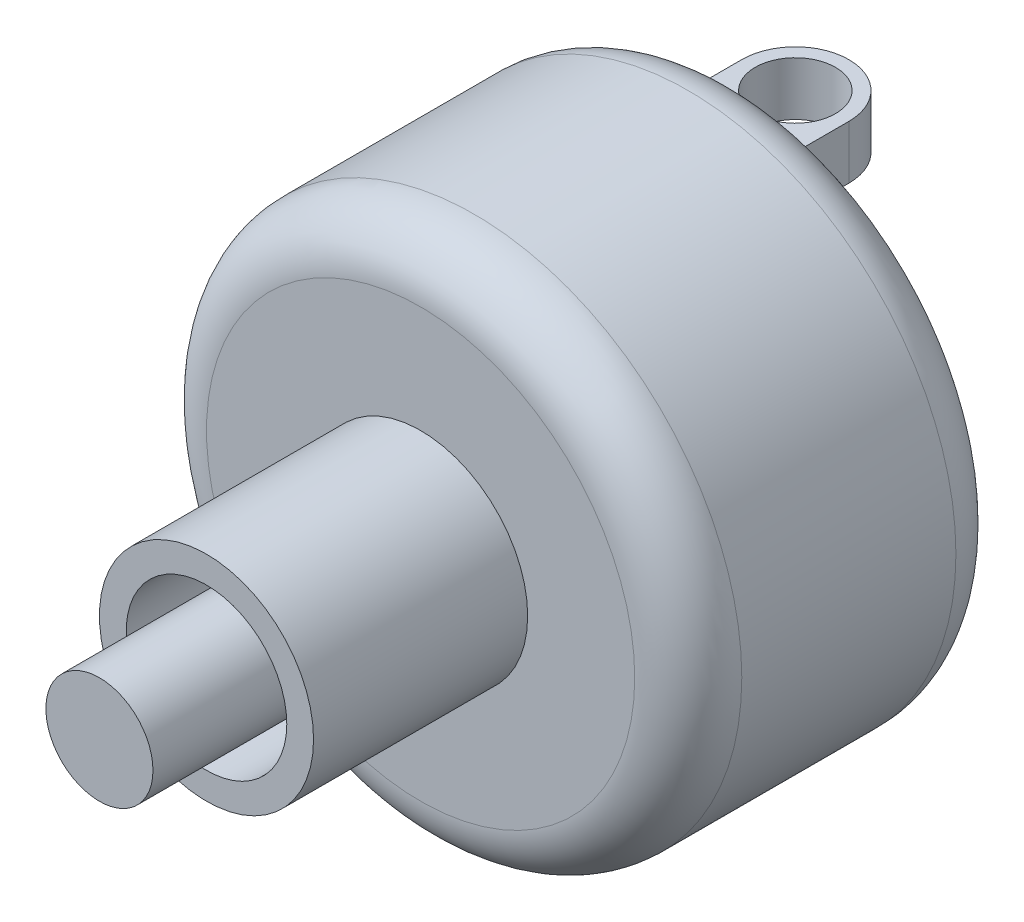
ISO-10303-21;
HEADER;
FILE_DESCRIPTION(('STEP AP214'),'2;1');
FILE_NAME('part.step','',(''),(''),'','','');
FILE_SCHEMA(('AUTOMOTIVE_DESIGN { 1 0 10303 214 1 1 1 1 }'));
ENDSEC;
DATA;
#1=APPLICATION_CONTEXT('core data for automotive mechanical design processes');
#2=APPLICATION_PROTOCOL_DEFINITION('international standard','automotive_design',2000,#1);
#3=PRODUCT_CONTEXT('',#1,'mechanical');
#4=PRODUCT('Part','Part','',(#3));
#5=PRODUCT_RELATED_PRODUCT_CATEGORY('part','',(#4));
#6=PRODUCT_DEFINITION_FORMATION('','',#4);
#7=PRODUCT_DEFINITION_CONTEXT('part definition',#1,'design');
#8=PRODUCT_DEFINITION('design','',#6,#7);
#9=PRODUCT_DEFINITION_SHAPE('','',#8);
#10=(LENGTH_UNIT() NAMED_UNIT(*) SI_UNIT(.MILLI.,.METRE.));
#11=(NAMED_UNIT(*) PLANE_ANGLE_UNIT() SI_UNIT($,.RADIAN.));
#12=(NAMED_UNIT(*) SI_UNIT($,.STERADIAN.) SOLID_ANGLE_UNIT());
#13=UNCERTAINTY_MEASURE_WITH_UNIT(LENGTH_MEASURE(1.E-05),#10,'distance_accuracy_value','');
#14=(GEOMETRIC_REPRESENTATION_CONTEXT(3) GLOBAL_UNCERTAINTY_ASSIGNED_CONTEXT((#13)) GLOBAL_UNIT_ASSIGNED_CONTEXT((#10,
#11,#12)) REPRESENTATION_CONTEXT('',''));
#15=CARTESIAN_POINT('',(0.,0.,0.));
#16=DIRECTION('',(0.,0.,1.));
#17=DIRECTION('',(1.,0.,0.));
#18=AXIS2_PLACEMENT_3D('',#15,#16,#17);
#19=CARTESIAN_POINT('',(0.,0.,0.));
#20=DIRECTION('',(0.,0.,1.));
#21=DIRECTION('',(1.,0.,0.));
#22=AXIS2_PLACEMENT_3D('',#19,#20,#21);
#23=PLANE('',#22);
#24=CARTESIAN_POINT('',(0.,0.,0.));
#25=DIRECTION('',(0.,0.,1.));
#26=DIRECTION('',(1.,0.,0.));
#27=AXIS2_PLACEMENT_3D('',#24,#25,#26);
#28=CIRCLE('',#27,8.5);
#29=CARTESIAN_POINT('',(8.5,0.,0.));
#30=VERTEX_POINT('',#29);
#31=EDGE_CURVE('E50',#30,#30,#28,.T.);
#32=ORIENTED_EDGE('',*,*,#31,.T.);
#33=EDGE_LOOP('',(#32));
#34=FACE_BOUND('',#33,.T.);
#35=DIRECTION('',(0.,1.,0.));
#36=VECTOR('',#35,1.);
#37=CARTESIAN_POINT('',(-5.,-20.,0.));
#38=LINE('',#37,#36);
#39=CARTESIAN_POINT('',(-5.,-19.3649167310371,0.));
#40=VERTEX_POINT('',#39);
#41=CARTESIAN_POINT('',(-5.,-15.,0.));
#42=VERTEX_POINT('',#41);
#43=EDGE_CURVE('E452',#40,#42,#38,.T.);
#44=ORIENTED_EDGE('',*,*,#43,.F.);
#45=CARTESIAN_POINT('',(0.,0.,0.));
#46=DIRECTION('',(0.,0.,1.));
#47=DIRECTION('',(1.,0.,0.));
#48=AXIS2_PLACEMENT_3D('',#45,#46,#47);
#49=CIRCLE('',#48,20.);
#50=CARTESIAN_POINT('',(-5.,19.3649167310371,0.));
#51=VERTEX_POINT('',#50);
#52=EDGE_CURVE('E155',#40,#51,#49,.F.);
#53=ORIENTED_EDGE('',*,*,#52,.T.);
#54=DIRECTION('',(0.,1.,0.));
#55=VECTOR('',#54,1.);
#56=CARTESIAN_POINT('',(-5.,15.,0.));
#57=LINE('',#56,#55);
#58=CARTESIAN_POINT('',(-5.,15.,0.));
#59=VERTEX_POINT('',#58);
#60=EDGE_CURVE('E139',#59,#51,#57,.T.);
#61=ORIENTED_EDGE('',*,*,#60,.F.);
#62=DIRECTION('',(-1.,0.,0.));
#63=VECTOR('',#62,1.);
#64=CARTESIAN_POINT('',(-5.,15.,0.));
#65=LINE('',#64,#63);
#66=CARTESIAN_POINT('',(5.,15.,0.));
#67=VERTEX_POINT('',#66);
#68=EDGE_CURVE('E147',#67,#59,#65,.T.);
#69=ORIENTED_EDGE('',*,*,#68,.F.);
#70=DIRECTION('',(0.,-1.,0.));
#71=VECTOR('',#70,1.);
#72=CARTESIAN_POINT('',(5.,15.,0.));
#73=LINE('',#72,#71);
#74=CARTESIAN_POINT('',(5.,19.3649167310371,0.));
#75=VERTEX_POINT('',#74);
#76=EDGE_CURVE('E157',#75,#67,#73,.T.);
#77=ORIENTED_EDGE('',*,*,#76,.F.);
#78=CARTESIAN_POINT('',(0.,0.,0.));
#79=DIRECTION('',(0.,0.,1.));
#80=DIRECTION('',(1.,0.,0.));
#81=AXIS2_PLACEMENT_3D('',#78,#79,#80);
#82=CIRCLE('',#81,20.);
#83=CARTESIAN_POINT('',(5.,-19.3649167310371,0.));
#84=VERTEX_POINT('',#83);
#85=EDGE_CURVE('E212',#75,#84,#82,.F.);
#86=ORIENTED_EDGE('',*,*,#85,.T.);
#87=DIRECTION('',(0.,-1.,0.));
#88=VECTOR('',#87,1.);
#89=CARTESIAN_POINT('',(5.,-20.,0.));
#90=LINE('',#89,#88);
#91=CARTESIAN_POINT('',(5.,-15.,0.));
#92=VERTEX_POINT('',#91);
#93=EDGE_CURVE('E487',#92,#84,#90,.T.);
#94=ORIENTED_EDGE('',*,*,#93,.F.);
#95=DIRECTION('',(1.,0.,0.));
#96=VECTOR('',#95,1.);
#97=CARTESIAN_POINT('',(-5.,-15.,0.));
#98=LINE('',#97,#96);
#99=EDGE_CURVE('E458',#42,#92,#98,.T.);
#100=ORIENTED_EDGE('',*,*,#99,.F.);
#101=EDGE_LOOP('',(#44,#53,#61,#69,#77,#86,#94,#100));
#102=FACE_BOUND('',#101,.T.);
#103=ADVANCED_FACE('F41',(#34,#102),#23,.F.);
#104=CARTESIAN_POINT('',(0.,0.,30.));
#105=DIRECTION('',(0.,0.,-1.));
#106=DIRECTION('',(-1.,0.,0.));
#107=AXIS2_PLACEMENT_3D('',#104,#105,#106);
#108=CYLINDRICAL_SURFACE('',#107,25.);
#109=CARTESIAN_POINT('',(0.,0.,25.));
#110=DIRECTION('',(0.,0.,1.));
#111=DIRECTION('',(1.,0.,0.));
#112=AXIS2_PLACEMENT_3D('',#109,#110,#111);
#113=CIRCLE('',#112,25.);
#114=CARTESIAN_POINT('',(25.,0.,25.));
#115=VERTEX_POINT('',#114);
#116=EDGE_CURVE('E208',#115,#115,#113,.F.);
#117=ORIENTED_EDGE('',*,*,#116,.T.);
#118=EDGE_LOOP('',(#117));
#119=FACE_BOUND('',#118,.T.);
#120=CARTESIAN_POINT('',(0.,0.,5.));
#121=DIRECTION('',(0.,0.,1.));
#122=DIRECTION('',(1.,0.,0.));
#123=AXIS2_PLACEMENT_3D('',#120,#121,#122);
#124=CIRCLE('',#123,25.);
#125=CARTESIAN_POINT('',(25.,0.,5.));
#126=VERTEX_POINT('',#125);
#127=EDGE_CURVE('E204',#126,#126,#124,.T.);
#128=ORIENTED_EDGE('',*,*,#127,.T.);
#129=EDGE_LOOP('',(#128));
#130=FACE_BOUND('',#129,.T.);
#131=ADVANCED_FACE('F333',(#119,#130),#108,.T.);
#132=CARTESIAN_POINT('',(0.,0.,30.));
#133=DIRECTION('',(0.,0.,1.));
#134=DIRECTION('',(1.,0.,0.));
#135=AXIS2_PLACEMENT_3D('',#132,#133,#134);
#136=PLANE('',#135);
#137=CARTESIAN_POINT('',(0.,0.,30.));
#138=DIRECTION('',(0.,0.,1.));
#139=DIRECTION('',(1.,0.,0.));
#140=AXIS2_PLACEMENT_3D('',#137,#138,#139);
#141=CIRCLE('',#140,20.);
#142=CARTESIAN_POINT('',(20.,0.,30.));
#143=VERTEX_POINT('',#142);
#144=EDGE_CURVE('E200',#143,#143,#141,.T.);
#145=ORIENTED_EDGE('',*,*,#144,.T.);
#146=EDGE_LOOP('',(#145));
#147=FACE_BOUND('',#146,.T.);
#148=CARTESIAN_POINT('',(0.,0.,30.));
#149=DIRECTION('',(0.,0.,1.));
#150=DIRECTION('',(1.,0.,0.));
#151=AXIS2_PLACEMENT_3D('',#148,#149,#150);
#152=CIRCLE('',#151,10.);
#153=CARTESIAN_POINT('',(10.,0.,30.));
#154=VERTEX_POINT('',#153);
#155=EDGE_CURVE('E196',#154,#154,#152,.T.);
#156=ORIENTED_EDGE('',*,*,#155,.F.);
#157=EDGE_LOOP('',(#156));
#158=FACE_BOUND('',#157,.T.);
#159=ADVANCED_FACE('F339',(#147,#158),#136,.T.);
#160=CARTESIAN_POINT('',(0.,0.,50.));
#161=DIRECTION('',(0.,0.,-1.));
#162=DIRECTION('',(-1.,0.,0.));
#163=AXIS2_PLACEMENT_3D('',#160,#161,#162);
#164=CYLINDRICAL_SURFACE('',#163,10.);
#165=CARTESIAN_POINT('',(0.,0.,50.));
#166=DIRECTION('',(0.,0.,1.));
#167=DIRECTION('',(1.,0.,0.));
#168=AXIS2_PLACEMENT_3D('',#165,#166,#167);
#169=CIRCLE('',#168,10.);
#170=CARTESIAN_POINT('',(10.,0.,50.));
#171=VERTEX_POINT('',#170);
#172=EDGE_CURVE('E189',#171,#171,#169,.T.);
#173=ORIENTED_EDGE('',*,*,#172,.F.);
#174=EDGE_LOOP('',(#173));
#175=FACE_BOUND('',#174,.T.);
#176=ORIENTED_EDGE('',*,*,#155,.T.);
#177=EDGE_LOOP('',(#176));
#178=FACE_BOUND('',#177,.T.);
#179=ADVANCED_FACE('F345',(#175,#178),#164,.T.);
#180=CARTESIAN_POINT('',(0.,0.,50.));
#181=DIRECTION('',(0.,0.,1.));
#182=DIRECTION('',(1.,0.,0.));
#183=AXIS2_PLACEMENT_3D('',#180,#181,#182);
#184=PLANE('',#183);
#185=CARTESIAN_POINT('',(0.,0.,50.));
#186=DIRECTION('',(0.,0.,1.));
#187=DIRECTION('',(1.,0.,0.));
#188=AXIS2_PLACEMENT_3D('',#185,#186,#187);
#189=CIRCLE('',#188,7.5);
#190=CARTESIAN_POINT('',(7.5,0.,50.));
#191=VERTEX_POINT('',#190);
#192=EDGE_CURVE('E181',#191,#191,#189,.T.);
#193=ORIENTED_EDGE('',*,*,#192,.F.);
#194=EDGE_LOOP('',(#193));
#195=FACE_BOUND('',#194,.T.);
#196=ORIENTED_EDGE('',*,*,#172,.T.);
#197=EDGE_LOOP('',(#196));
#198=FACE_BOUND('',#197,.T.);
#199=ADVANCED_FACE('F349',(#195,#198),#184,.T.);
#200=CARTESIAN_POINT('',(0.,0.,30.));
#201=DIRECTION('',(0.,0.,1.));
#202=DIRECTION('',(1.,0.,0.));
#203=AXIS2_PLACEMENT_3D('',#200,#201,#202);
#204=CYLINDRICAL_SURFACE('',#203,7.5);
#205=CARTESIAN_POINT('',(0.,0.,30.));
#206=DIRECTION('',(0.,0.,1.));
#207=DIRECTION('',(1.,0.,0.));
#208=AXIS2_PLACEMENT_3D('',#205,#206,#207);
#209=CIRCLE('',#208,7.5);
#210=CARTESIAN_POINT('',(7.5,0.,30.));
#211=VERTEX_POINT('',#210);
#212=EDGE_CURVE('E185',#211,#211,#209,.T.);
#213=ORIENTED_EDGE('',*,*,#212,.F.);
#214=EDGE_LOOP('',(#213));
#215=FACE_BOUND('',#214,.T.);
#216=ORIENTED_EDGE('',*,*,#192,.T.);
#217=EDGE_LOOP('',(#216));
#218=FACE_BOUND('',#217,.T.);
#219=ADVANCED_FACE('F353',(#215,#218),#204,.F.);
#220=CARTESIAN_POINT('',(0.,0.,30.));
#221=DIRECTION('',(0.,0.,1.));
#222=DIRECTION('',(1.,0.,0.));
#223=AXIS2_PLACEMENT_3D('',#220,#221,#222);
#224=PLANE('',#223);
#225=CARTESIAN_POINT('',(0.,0.,30.));
#226=DIRECTION('',(0.,0.,1.));
#227=DIRECTION('',(1.,0.,0.));
#228=AXIS2_PLACEMENT_3D('',#225,#226,#227);
#229=CIRCLE('',#228,5.);
#230=CARTESIAN_POINT('',(5.,0.,30.));
#231=VERTEX_POINT('',#230);
#232=EDGE_CURVE('E176',#231,#231,#229,.T.);
#233=ORIENTED_EDGE('',*,*,#232,.F.);
#234=EDGE_LOOP('',(#233));
#235=FACE_BOUND('',#234,.T.);
#236=ORIENTED_EDGE('',*,*,#212,.T.);
#237=EDGE_LOOP('',(#236));
#238=FACE_BOUND('',#237,.T.);
#239=ADVANCED_FACE('F357',(#235,#238),#224,.T.);
#240=CARTESIAN_POINT('',(0.,0.,60.));
#241=DIRECTION('',(0.,0.,-1.));
#242=DIRECTION('',(-1.,0.,0.));
#243=AXIS2_PLACEMENT_3D('',#240,#241,#242);
#244=CYLINDRICAL_SURFACE('',#243,5.);
#245=CARTESIAN_POINT('',(0.,0.,60.));
#246=DIRECTION('',(0.,0.,1.));
#247=DIRECTION('',(1.,0.,0.));
#248=AXIS2_PLACEMENT_3D('',#245,#246,#247);
#249=CIRCLE('',#248,5.);
#250=CARTESIAN_POINT('',(5.,0.,60.));
#251=VERTEX_POINT('',#250);
#252=EDGE_CURVE('E177',#251,#251,#249,.T.);
#253=ORIENTED_EDGE('',*,*,#252,.F.);
#254=EDGE_LOOP('',(#253));
#255=FACE_BOUND('',#254,.T.);
#256=ORIENTED_EDGE('',*,*,#232,.T.);
#257=EDGE_LOOP('',(#256));
#258=FACE_BOUND('',#257,.T.);
#259=ADVANCED_FACE('F361',(#255,#258),#244,.T.);
#260=CARTESIAN_POINT('',(0.,0.,60.));
#261=DIRECTION('',(0.,0.,1.));
#262=DIRECTION('',(1.,0.,0.));
#263=AXIS2_PLACEMENT_3D('',#260,#261,#262);
#264=PLANE('',#263);
#265=ORIENTED_EDGE('',*,*,#252,.T.);
#266=EDGE_LOOP('',(#265));
#267=FACE_BOUND('',#266,.T.);
#268=ADVANCED_FACE('F365',(#267),#264,.T.);
#269=CARTESIAN_POINT('',(0.,0.,-5.));
#270=DIRECTION('',(0.,0.,1.));
#271=DIRECTION('',(1.,0.,0.));
#272=AXIS2_PLACEMENT_3D('',#269,#270,#271);
#273=CYLINDRICAL_SURFACE('',#272,7.5);
#274=CARTESIAN_POINT('',(0.,0.,-1.));
#275=DIRECTION('',(0.,0.,1.));
#276=DIRECTION('',(1.,0.,0.));
#277=AXIS2_PLACEMENT_3D('',#274,#275,#276);
#278=CIRCLE('',#277,7.5);
#279=CARTESIAN_POINT('',(7.5,0.,-1.));
#280=VERTEX_POINT('',#279);
#281=EDGE_CURVE('E392',#280,#280,#278,.F.);
#282=ORIENTED_EDGE('',*,*,#281,.T.);
#283=EDGE_LOOP('',(#282));
#284=FACE_BOUND('',#283,.T.);
#285=CARTESIAN_POINT('',(0.,0.,-4.));
#286=DIRECTION('',(0.,0.,-1.));
#287=DIRECTION('',(-1.,0.,0.));
#288=AXIS2_PLACEMENT_3D('',#285,#286,#287);
#289=CIRCLE('',#288,7.5);
#290=CARTESIAN_POINT('',(-7.5,0.,-4.));
#291=VERTEX_POINT('',#290);
#292=EDGE_CURVE('E389',#291,#291,#289,.F.);
#293=ORIENTED_EDGE('',*,*,#292,.T.);
#294=EDGE_LOOP('',(#293));
#295=FACE_BOUND('',#294,.T.);
#296=ADVANCED_FACE('F369',(#284,#295),#273,.T.);
#297=CARTESIAN_POINT('',(0.,0.,-5.));
#298=DIRECTION('',(0.,0.,-1.));
#299=DIRECTION('',(-1.,0.,0.));
#300=AXIS2_PLACEMENT_3D('',#297,#298,#299);
#301=PLANE('',#300);
#302=CARTESIAN_POINT('',(0.,0.,-5.));
#303=DIRECTION('',(0.,0.,-1.));
#304=DIRECTION('',(-1.,0.,0.));
#305=AXIS2_PLACEMENT_3D('',#302,#303,#304);
#306=CIRCLE('',#305,6.5);
#307=CARTESIAN_POINT('',(-6.5,0.,-5.));
#308=VERTEX_POINT('',#307);
#309=EDGE_CURVE('E11',#308,#308,#306,.T.);
#310=ORIENTED_EDGE('',*,*,#309,.T.);
#311=EDGE_LOOP('',(#310));
#312=FACE_BOUND('',#311,.T.);
#313=ADVANCED_FACE('F330',(#312),#301,.T.);
#314=CARTESIAN_POINT('',(-5.,15.,-10.));
#315=DIRECTION('',(1.,0.,0.));
#316=DIRECTION('',(0.,1.,0.));
#317=AXIS2_PLACEMENT_3D('',#314,#315,#316);
#318=PLANE('',#317);
#319=DIRECTION('',(0.,0.,1.));
#320=VECTOR('',#319,1.);
#321=CARTESIAN_POINT('',(-5.,20.,-10.));
#322=LINE('',#321,#320);
#323=CARTESIAN_POINT('',(-5.,20.,-5.));
#324=VERTEX_POINT('',#323);
#325=CARTESIAN_POINT('',(-5.,20.,0.0380321319528795));
#326=VERTEX_POINT('',#325);
#327=EDGE_CURVE('E173',#324,#326,#322,.T.);
#328=ORIENTED_EDGE('',*,*,#327,.F.);
#329=DIRECTION('',(0.,1.,0.));
#330=VECTOR('',#329,1.);
#331=CARTESIAN_POINT('',(-5.,15.,-5.));
#332=LINE('',#331,#330);
#333=CARTESIAN_POINT('',(-5.,15.,-5.));
#334=VERTEX_POINT('',#333);
#335=EDGE_CURVE('E141',#324,#334,#332,.F.);
#336=ORIENTED_EDGE('',*,*,#335,.T.);
#337=DIRECTION('',(0.,0.,1.));
#338=VECTOR('',#337,1.);
#339=CARTESIAN_POINT('',(-5.,15.,-10.));
#340=LINE('',#339,#338);
#341=EDGE_CURVE('E135',#334,#59,#340,.T.);
#342=ORIENTED_EDGE('',*,*,#341,.T.);
#343=ORIENTED_EDGE('',*,*,#60,.T.);
#344=CARTESIAN_POINT('',(-5.,19.3649167310371,0.));
#345=CARTESIAN_POINT('',(-5.,19.4711435408004,-1.59857103890314E-06));
#346=CARTESIAN_POINT('',(-5.,19.5771805060712,0.00316694102008982));
#347=CARTESIAN_POINT('',(-5.,19.788874929712,0.0158443074308182));
#348=CARTESIAN_POINT('',(-5.,19.8945323874288,0.025353145157313));
#349=CARTESIAN_POINT('',(-5.,20.,0.0380321319528704));
#350=B_SPLINE_CURVE_WITH_KNOTS('',3,(#344,#345,#346,#347,#348,#349),.UNSPECIFIED.,.F.,.F.,(4,2,
4),(0.,0.318252885019034,0.636506317513864),.UNSPECIFIED.);
#351=EDGE_CURVE('E217',#51,#326,#350,.T.);
#352=ORIENTED_EDGE('',*,*,#351,.T.);
#353=EDGE_LOOP('',(#328,#336,#342,#343,#352));
#354=FACE_BOUND('',#353,.T.);
#355=ADVANCED_FACE('F137',(#354),#318,.F.);
#356=CARTESIAN_POINT('',(-5.,20.,-10.));
#357=DIRECTION('',(0.,-1.,0.));
#358=DIRECTION('',(1.,0.,0.));
#359=AXIS2_PLACEMENT_3D('',#356,#357,#358);
#360=PLANE('',#359);
#361=CARTESIAN_POINT('',(0.,20.,-5.));
#362=DIRECTION('',(0.,1.,0.));
#363=DIRECTION('',(-1.,0.,0.));
#364=AXIS2_PLACEMENT_3D('',#361,#362,#363);
#365=CIRCLE('',#364,3.75);
#366=CARTESIAN_POINT('',(-3.74999999999999,20.,-5.));
#367=VERTEX_POINT('',#366);
#368=EDGE_CURVE('E521',#367,#367,#365,.T.);
#369=ORIENTED_EDGE('',*,*,#368,.F.);
#370=EDGE_LOOP('',(#369));
#371=FACE_BOUND('',#370,.T.);
#372=DIRECTION('',(0.,0.,1.));
#373=VECTOR('',#372,1.);
#374=CARTESIAN_POINT('',(5.,20.,-10.));
#375=LINE('',#374,#373);
#376=CARTESIAN_POINT('',(5.,20.,-5.));
#377=VERTEX_POINT('',#376);
#378=CARTESIAN_POINT('',(5.,20.,0.0380321319528778));
#379=VERTEX_POINT('',#378);
#380=EDGE_CURVE('E170',#377,#379,#375,.T.);
#381=ORIENTED_EDGE('',*,*,#380,.F.);
#382=CARTESIAN_POINT('',(0.,20.,-5.));
#383=DIRECTION('',(0.,-1.,0.));
#384=DIRECTION('',(1.,0.,0.));
#385=AXIS2_PLACEMENT_3D('',#382,#383,#384);
#386=CIRCLE('',#385,5.);
#387=CARTESIAN_POINT('',(0.,20.,-10.));
#388=VERTEX_POINT('',#387);
#389=EDGE_CURVE('E62',#377,#388,#386,.F.);
#390=ORIENTED_EDGE('',*,*,#389,.T.);
#391=CARTESIAN_POINT('',(0.,20.,-5.));
#392=DIRECTION('',(0.,-1.,0.));
#393=DIRECTION('',(1.,0.,0.));
#394=AXIS2_PLACEMENT_3D('',#391,#392,#393);
#395=CIRCLE('',#394,5.);
#396=EDGE_CURVE('E57',#388,#324,#395,.F.);
#397=ORIENTED_EDGE('',*,*,#396,.T.);
#398=ORIENTED_EDGE('',*,*,#327,.T.);
#399=CARTESIAN_POINT('',(-5.,20.,0.0380321319528789));
#400=CARTESIAN_POINT('',(-4.79172627708819,20.,0.0317770860692456));
#401=CARTESIAN_POINT('',(-4.58342331012892,20.,0.0266509781953639));
#402=CARTESIAN_POINT('',(-4.16678753030685,20.,0.0181852564625262));
#403=CARTESIAN_POINT('',(-3.95845471870868,20.,0.0148455815006976));
#404=CARTESIAN_POINT('',(-3.54178342100838,20.,0.00948110610459965));
#405=CARTESIAN_POINT('',(-3.33344493563177,20.,0.00745624395064969));
#406=CARTESIAN_POINT('',(-2.91675939888512,20.,0.00432982564868455));
#407=CARTESIAN_POINT('',(-2.70841234745178,20.,0.00322827841668376));
#408=CARTESIAN_POINT('',(-2.29173129729011,20.,0.00161848481480243));
#409=CARTESIAN_POINT('',(-2.08339729870398,20.,0.00111019566597089));
#410=CARTESIAN_POINT('',(-1.66672960605639,20.,0.000428330578891939));
#411=CARTESIAN_POINT('',(-1.45839591199652,20.,0.000254753442649956));
#412=CARTESIAN_POINT('',(-1.04171872902487,20.,4.98880398136789E-05));
#413=CARTESIAN_POINT('',(-0.833375240111585,20.,1.86064411764695E-05));
#414=CARTESIAN_POINT('',(-0.41668783052716,20.,4.61610223762926E-07));
#415=CARTESIAN_POINT('',(-0.208343909856013,20.,1.35984688042701E-05));
#416=CARTESIAN_POINT('',(0.,20.,0.));
#417=B_SPLINE_CURVE_WITH_KNOTS('',3,(#399,#400,#401,#402,#403,#404,#405,#406,#407,#408,#409,
#410,#411,#412,#413,#414,#415,#416),.UNSPECIFIED.,.F.,.F.,(4,2,2,2,2,2,2,2,4),(0.,
0.625093183831321,1.25016498570549,1.87520744346218,2.50025593688797,3.12525935621882,
3.75026053854571,4.37529100807446,5.00032275663922),.UNSPECIFIED.);
#418=CARTESIAN_POINT('',(0.,20.,0.));
#419=VERTEX_POINT('',#418);
#420=EDGE_CURVE('E226',#326,#419,#417,.T.);
#421=ORIENTED_EDGE('',*,*,#420,.T.);
#422=CARTESIAN_POINT('',(0.,20.,0.));
#423=CARTESIAN_POINT('',(0.208343909856026,20.,1.35984688049139E-05));
#424=CARTESIAN_POINT('',(0.416687830527172,20.,4.61610224618808E-07));
#425=CARTESIAN_POINT('',(0.833375240111596,20.,1.86064411769823E-05));
#426=CARTESIAN_POINT('',(1.04171872902488,20.,4.98880398136365E-05));
#427=CARTESIAN_POINT('',(1.45839591199653,20.,0.000254753442649378));
#428=CARTESIAN_POINT('',(1.6667296060564,20.,0.000428330578891381));
#429=CARTESIAN_POINT('',(2.08339729870398,20.,0.00111019566597043));
#430=CARTESIAN_POINT('',(2.29173129729012,20.,0.00161848481480206));
#431=CARTESIAN_POINT('',(2.70841234745178,20.,0.00322827841668329));
#432=CARTESIAN_POINT('',(2.91675939888512,20.,0.0043298256486839));
#433=CARTESIAN_POINT('',(3.33344493563178,20.,0.00745624395064911));
#434=CARTESIAN_POINT('',(3.54178342100838,20.,0.00948110610459933));
#435=CARTESIAN_POINT('',(3.95845471870868,20.,0.014845581500698));
#436=CARTESIAN_POINT('',(4.16678753030685,20.,0.0181852564625271));
#437=CARTESIAN_POINT('',(4.58342331012892,20.,0.0266509781953627));
#438=CARTESIAN_POINT('',(4.79172627708819,20.,0.0317770860692421));
#439=CARTESIAN_POINT('',(5.,20.,0.03803213195287));
#440=B_SPLINE_CURVE_WITH_KNOTS('',3,(#422,#423,#424,#425,#426,#427,#428,#429,#430,#431,#432,
#433,#434,#435,#436,#437,#438,#439),.UNSPECIFIED.,.F.,.F.,(4,2,2,2,2,2,2,2,4),(0.,
0.625031748564763,1.25006221809351,1.8750634004204,2.50006681975125,3.12511531317704,
3.75015777093372,4.37522957280789,5.00032275663921),.UNSPECIFIED.);
#441=EDGE_CURVE('E252',#419,#379,#440,.T.);
#442=ORIENTED_EDGE('',*,*,#441,.T.);
#443=EDGE_LOOP('',(#381,#390,#397,#398,#421,#442));
#444=FACE_BOUND('',#443,.T.);
#445=ADVANCED_FACE('F321',(#371,#444),#360,.F.);
#446=CARTESIAN_POINT('',(5.,15.,-10.));
#447=DIRECTION('',(-1.,0.,0.));
#448=DIRECTION('',(0.,-1.,0.));
#449=AXIS2_PLACEMENT_3D('',#446,#447,#448);
#450=PLANE('',#449);
#451=DIRECTION('',(0.,0.,1.));
#452=VECTOR('',#451,1.);
#453=CARTESIAN_POINT('',(5.,15.,-10.));
#454=LINE('',#453,#452);
#455=CARTESIAN_POINT('',(5.,15.,-5.));
#456=VERTEX_POINT('',#455);
#457=EDGE_CURVE('E146',#456,#67,#454,.T.);
#458=ORIENTED_EDGE('',*,*,#457,.F.);
#459=DIRECTION('',(0.,-1.,0.));
#460=VECTOR('',#459,1.);
#461=CARTESIAN_POINT('',(5.,20.,-5.));
#462=LINE('',#461,#460);
#463=EDGE_CURVE('E417',#456,#377,#462,.F.);
#464=ORIENTED_EDGE('',*,*,#463,.T.);
#465=ORIENTED_EDGE('',*,*,#380,.T.);
#466=CARTESIAN_POINT('',(5.,20.,0.038032131952878));
#467=CARTESIAN_POINT('',(5.,19.8945323874288,0.025353145157317));
#468=CARTESIAN_POINT('',(5.,19.788874929712,0.0158443074308195));
#469=CARTESIAN_POINT('',(5.,19.5771805060712,0.00316694102008734));
#470=CARTESIAN_POINT('',(5.,19.4711435408004,-1.59857104240746E-06));
#471=CARTESIAN_POINT('',(5.,19.3649167310371,0.));
#472=B_SPLINE_CURVE_WITH_KNOTS('',3,(#466,#467,#468,#469,#470,#471),.UNSPECIFIED.,.F.,.F.,(4,2,
4),(0.,0.318253432494831,0.636506317513862),.UNSPECIFIED.);
#473=EDGE_CURVE('E259',#379,#75,#472,.T.);
#474=ORIENTED_EDGE('',*,*,#473,.T.);
#475=ORIENTED_EDGE('',*,*,#76,.T.);
#476=EDGE_LOOP('',(#458,#464,#465,#474,#475));
#477=FACE_BOUND('',#476,.T.);
#478=ADVANCED_FACE('F317',(#477),#450,.F.);
#479=CARTESIAN_POINT('',(-5.,15.,-10.));
#480=DIRECTION('',(0.,1.,0.));
#481=DIRECTION('',(0.,0.,1.));
#482=AXIS2_PLACEMENT_3D('',#479,#480,#481);
#483=PLANE('',#482);
#484=CARTESIAN_POINT('',(0.,15.,-5.));
#485=DIRECTION('',(0.,1.,0.));
#486=DIRECTION('',(0.,0.,1.));
#487=AXIS2_PLACEMENT_3D('',#484,#485,#486);
#488=CIRCLE('',#487,3.75);
#489=CARTESIAN_POINT('',(0.,15.,-1.25));
#490=VERTEX_POINT('',#489);
#491=EDGE_CURVE('E460',#490,#490,#488,.F.);
#492=ORIENTED_EDGE('',*,*,#491,.F.);
#493=EDGE_LOOP('',(#492));
#494=FACE_BOUND('',#493,.T.);
#495=CARTESIAN_POINT('',(0.,15.,-5.));
#496=DIRECTION('',(0.,1.,0.));
#497=DIRECTION('',(0.,0.,1.));
#498=AXIS2_PLACEMENT_3D('',#495,#496,#497);
#499=CIRCLE('',#498,5.);
#500=CARTESIAN_POINT('',(0.,15.,-10.));
#501=VERTEX_POINT('',#500);
#502=EDGE_CURVE('E424',#334,#501,#499,.F.);
#503=ORIENTED_EDGE('',*,*,#502,.T.);
#504=CARTESIAN_POINT('',(0.,15.,-5.));
#505=DIRECTION('',(0.,1.,0.));
#506=DIRECTION('',(0.,0.,1.));
#507=AXIS2_PLACEMENT_3D('',#504,#505,#506);
#508=CIRCLE('',#507,5.);
#509=EDGE_CURVE('E421',#501,#456,#508,.F.);
#510=ORIENTED_EDGE('',*,*,#509,.T.);
#511=ORIENTED_EDGE('',*,*,#457,.T.);
#512=ORIENTED_EDGE('',*,*,#68,.T.);
#513=ORIENTED_EDGE('',*,*,#341,.F.);
#514=EDGE_LOOP('',(#503,#510,#511,#512,#513));
#515=FACE_BOUND('',#514,.T.);
#516=ADVANCED_FACE('F160',(#494,#515),#483,.F.);
#517=CARTESIAN_POINT('',(-5.,-20.,-10.));
#518=DIRECTION('',(1.,0.,0.));
#519=DIRECTION('',(0.,1.,0.));
#520=AXIS2_PLACEMENT_3D('',#517,#518,#519);
#521=PLANE('',#520);
#522=DIRECTION('',(0.,0.,1.));
#523=VECTOR('',#522,1.);
#524=CARTESIAN_POINT('',(-5.,-15.,-10.));
#525=LINE('',#524,#523);
#526=CARTESIAN_POINT('',(-5.,-15.,-5.));
#527=VERTEX_POINT('',#526);
#528=EDGE_CURVE('E158',#527,#42,#525,.T.);
#529=ORIENTED_EDGE('',*,*,#528,.F.);
#530=DIRECTION('',(0.,1.,0.));
#531=VECTOR('',#530,1.);
#532=CARTESIAN_POINT('',(-5.,-20.,-5.));
#533=LINE('',#532,#531);
#534=CARTESIAN_POINT('',(-5.,-20.,-5.));
#535=VERTEX_POINT('',#534);
#536=EDGE_CURVE('E427',#527,#535,#533,.F.);
#537=ORIENTED_EDGE('',*,*,#536,.T.);
#538=DIRECTION('',(0.,0.,1.));
#539=VECTOR('',#538,1.);
#540=CARTESIAN_POINT('',(-5.,-20.,-10.));
#541=LINE('',#540,#539);
#542=CARTESIAN_POINT('',(-5.,-20.,0.0380321319528795));
#543=VERTEX_POINT('',#542);
#544=EDGE_CURVE('E454',#535,#543,#541,.T.);
#545=ORIENTED_EDGE('',*,*,#544,.T.);
#546=CARTESIAN_POINT('',(-5.,-20.,0.0380321319528789));
#547=CARTESIAN_POINT('',(-5.,-19.8945323874288,0.0253531451573182));
#548=CARTESIAN_POINT('',(-5.,-19.788874929712,0.0158443074308208));
#549=CARTESIAN_POINT('',(-5.,-19.5771805060712,0.00316694102008812));
#550=CARTESIAN_POINT('',(-5.,-19.4711435408004,-1.59857104212891E-06));
#551=CARTESIAN_POINT('',(-5.,-19.3649167310371,0.));
#552=B_SPLINE_CURVE_WITH_KNOTS('',3,(#546,#547,#548,#549,#550,#551),.UNSPECIFIED.,.F.,.F.,(4,2,
4),(0.,0.318253432494831,0.636506317513865),.UNSPECIFIED.);
#553=EDGE_CURVE('E288',#543,#40,#552,.T.);
#554=ORIENTED_EDGE('',*,*,#553,.T.);
#555=ORIENTED_EDGE('',*,*,#43,.T.);
#556=EDGE_LOOP('',(#529,#537,#545,#554,#555));
#557=FACE_BOUND('',#556,.T.);
#558=ADVANCED_FACE('F310',(#557),#521,.F.);
#559=CARTESIAN_POINT('',(-5.,-15.,-10.));
#560=DIRECTION('',(0.,-1.,0.));
#561=DIRECTION('',(0.,0.,-1.));
#562=AXIS2_PLACEMENT_3D('',#559,#560,#561);
#563=PLANE('',#562);
#564=CARTESIAN_POINT('',(0.,-15.,-5.));
#565=DIRECTION('',(0.,-1.,0.));
#566=DIRECTION('',(0.,0.,-1.));
#567=AXIS2_PLACEMENT_3D('',#564,#565,#566);
#568=CIRCLE('',#567,3.75);
#569=CARTESIAN_POINT('',(0.,-15.,-8.75));
#570=VERTEX_POINT('',#569);
#571=EDGE_CURVE('E525',#570,#570,#568,.F.);
#572=ORIENTED_EDGE('',*,*,#571,.F.);
#573=EDGE_LOOP('',(#572));
#574=FACE_BOUND('',#573,.T.);
#575=DIRECTION('',(0.,0.,1.));
#576=VECTOR('',#575,1.);
#577=CARTESIAN_POINT('',(5.,-15.,-10.));
#578=LINE('',#577,#576);
#579=CARTESIAN_POINT('',(5.,-15.,-5.));
#580=VERTEX_POINT('',#579);
#581=EDGE_CURVE('E491',#580,#92,#578,.T.);
#582=ORIENTED_EDGE('',*,*,#581,.F.);
#583=CARTESIAN_POINT('',(0.,-15.,-5.));
#584=DIRECTION('',(0.,-1.,0.));
#585=DIRECTION('',(0.,0.,-1.));
#586=AXIS2_PLACEMENT_3D('',#583,#584,#585);
#587=CIRCLE('',#586,5.);
#588=CARTESIAN_POINT('',(0.,-15.,-10.));
#589=VERTEX_POINT('',#588);
#590=EDGE_CURVE('E430',#580,#589,#587,.F.);
#591=ORIENTED_EDGE('',*,*,#590,.T.);
#592=CARTESIAN_POINT('',(0.,-15.,-5.));
#593=DIRECTION('',(0.,-1.,0.));
#594=DIRECTION('',(0.,0.,-1.));
#595=AXIS2_PLACEMENT_3D('',#592,#593,#594);
#596=CIRCLE('',#595,5.);
#597=EDGE_CURVE('E433',#589,#527,#596,.F.);
#598=ORIENTED_EDGE('',*,*,#597,.T.);
#599=ORIENTED_EDGE('',*,*,#528,.T.);
#600=ORIENTED_EDGE('',*,*,#99,.T.);
#601=EDGE_LOOP('',(#582,#591,#598,#599,#600));
#602=FACE_BOUND('',#601,.T.);
#603=ADVANCED_FACE('F307',(#574,#602),#563,.F.);
#604=CARTESIAN_POINT('',(5.,-20.,-10.));
#605=DIRECTION('',(-1.,0.,0.));
#606=DIRECTION('',(0.,-1.,0.));
#607=AXIS2_PLACEMENT_3D('',#604,#605,#606);
#608=PLANE('',#607);
#609=DIRECTION('',(0.,0.,1.));
#610=VECTOR('',#609,1.);
#611=CARTESIAN_POINT('',(5.,-20.,-10.));
#612=LINE('',#611,#610);
#613=CARTESIAN_POINT('',(5.,-20.,-5.));
#614=VERTEX_POINT('',#613);
#615=CARTESIAN_POINT('',(5.,-20.,0.0380321319528795));
#616=VERTEX_POINT('',#615);
#617=EDGE_CURVE('E486',#614,#616,#612,.T.);
#618=ORIENTED_EDGE('',*,*,#617,.F.);
#619=DIRECTION('',(0.,-1.,0.));
#620=VECTOR('',#619,1.);
#621=CARTESIAN_POINT('',(5.,-15.,-5.));
#622=LINE('',#621,#620);
#623=EDGE_CURVE('E436',#614,#580,#622,.F.);
#624=ORIENTED_EDGE('',*,*,#623,.T.);
#625=ORIENTED_EDGE('',*,*,#581,.T.);
#626=ORIENTED_EDGE('',*,*,#93,.T.);
#627=CARTESIAN_POINT('',(5.,-19.3649167310371,0.));
#628=CARTESIAN_POINT('',(5.,-19.4711435408004,-1.59857103890314E-06));
#629=CARTESIAN_POINT('',(5.,-19.5771805060712,0.00316694102008982));
#630=CARTESIAN_POINT('',(5.,-19.788874929712,0.0158443074308182));
#631=CARTESIAN_POINT('',(5.,-19.8945323874288,0.025353145157313));
#632=CARTESIAN_POINT('',(5.,-20.,0.0380321319528704));
#633=B_SPLINE_CURVE_WITH_KNOTS('',3,(#627,#628,#629,#630,#631,#632),.UNSPECIFIED.,.F.,.F.,(4,2,
4),(0.,0.318252885019034,0.636506317513864),.UNSPECIFIED.);
#634=EDGE_CURVE('E267',#84,#616,#633,.T.);
#635=ORIENTED_EDGE('',*,*,#634,.T.);
#636=EDGE_LOOP('',(#618,#624,#625,#626,#635));
#637=FACE_BOUND('',#636,.T.);
#638=ADVANCED_FACE('F300',(#637),#608,.F.);
#639=CARTESIAN_POINT('',(-5.,-20.,-10.));
#640=DIRECTION('',(0.,1.,0.));
#641=DIRECTION('',(0.,0.,1.));
#642=AXIS2_PLACEMENT_3D('',#639,#640,#641);
#643=PLANE('',#642);
#644=CARTESIAN_POINT('',(0.,-20.,-5.));
#645=DIRECTION('',(0.,-1.,0.));
#646=DIRECTION('',(0.,0.,-1.));
#647=AXIS2_PLACEMENT_3D('',#644,#645,#646);
#648=CIRCLE('',#647,3.75);
#649=CARTESIAN_POINT('',(0.,-20.,-8.75));
#650=VERTEX_POINT('',#649);
#651=EDGE_CURVE('E411',#650,#650,#648,.T.);
#652=ORIENTED_EDGE('',*,*,#651,.F.);
#653=EDGE_LOOP('',(#652));
#654=FACE_BOUND('',#653,.T.);
#655=CARTESIAN_POINT('',(0.,-20.,-5.));
#656=DIRECTION('',(0.,1.,0.));
#657=DIRECTION('',(0.,0.,1.));
#658=AXIS2_PLACEMENT_3D('',#655,#656,#657);
#659=CIRCLE('',#658,5.);
#660=CARTESIAN_POINT('',(0.,-20.,-10.));
#661=VERTEX_POINT('',#660);
#662=EDGE_CURVE('E442',#535,#661,#659,.F.);
#663=ORIENTED_EDGE('',*,*,#662,.T.);
#664=CARTESIAN_POINT('',(0.,-20.,-5.));
#665=DIRECTION('',(0.,1.,0.));
#666=DIRECTION('',(0.,0.,1.));
#667=AXIS2_PLACEMENT_3D('',#664,#665,#666);
#668=CIRCLE('',#667,5.);
#669=EDGE_CURVE('E440',#661,#614,#668,.F.);
#670=ORIENTED_EDGE('',*,*,#669,.T.);
#671=ORIENTED_EDGE('',*,*,#617,.T.);
#672=CARTESIAN_POINT('',(5.,-20.,0.0380321319528789));
#673=CARTESIAN_POINT('',(4.79172627708819,-20.,0.0317770860692447));
#674=CARTESIAN_POINT('',(4.58342331012892,-20.,0.026650978195363));
#675=CARTESIAN_POINT('',(4.16678753030685,-20.,0.0181852564625259));
#676=CARTESIAN_POINT('',(3.95845471870868,-20.,0.0148455815006978));
#677=CARTESIAN_POINT('',(3.54178342100838,-20.,0.0094811061046001));
#678=CARTESIAN_POINT('',(3.33344493563177,-20.,0.00745624395064981));
#679=CARTESIAN_POINT('',(2.91675939888512,-20.,0.00432982564868401));
#680=CARTESIAN_POINT('',(2.70841234745178,-20.,0.00322827841668288));
#681=CARTESIAN_POINT('',(2.29173129729012,-20.,0.00161848481480187));
#682=CARTESIAN_POINT('',(2.08339729870398,-20.,0.00111019566597097));
#683=CARTESIAN_POINT('',(1.66672960605639,-20.,0.000428330578892157));
#684=CARTESIAN_POINT('',(1.45839591199652,-20.,0.000254753442649663));
#685=CARTESIAN_POINT('',(1.04171872902488,-20.,4.98880398131644E-05));
#686=CARTESIAN_POINT('',(0.833375240111591,-20.,1.86064411762441E-05));
#687=CARTESIAN_POINT('',(0.416687830527166,-20.,4.61610224084615E-07));
#688=CARTESIAN_POINT('',(0.20834390985602,-20.,1.35984688048497E-05));
#689=CARTESIAN_POINT('',(0.,-20.,0.));
#690=B_SPLINE_CURVE_WITH_KNOTS('',3,(#672,#673,#674,#675,#676,#677,#678,#679,#680,#681,#682,
#683,#684,#685,#686,#687,#688,#689),.UNSPECIFIED.,.F.,.F.,(4,2,2,2,2,2,2,2,4),(0.,
0.62509318383132,1.25016498570549,1.87520744346218,2.50025593688796,3.12525935621882,
3.75026053854571,4.37529100807445,5.00032275663922),.UNSPECIFIED.);
#691=CARTESIAN_POINT('',(0.,-20.,0.));
#692=VERTEX_POINT('',#691);
#693=EDGE_CURVE('E274',#616,#692,#690,.T.);
#694=ORIENTED_EDGE('',*,*,#693,.T.);
#695=CARTESIAN_POINT('',(0.,-20.,0.));
#696=CARTESIAN_POINT('',(-0.208343909856019,-20.,1.35984688039373E-05));
#697=CARTESIAN_POINT('',(-0.416687830527166,-20.,4.61610223582308E-07));
#698=CARTESIAN_POINT('',(-0.83337524011159,-20.,1.86064411764172E-05));
#699=CARTESIAN_POINT('',(-1.04171872902488,-20.,4.98880398136027E-05));
#700=CARTESIAN_POINT('',(-1.45839591199652,-20.,0.000254753442649758));
#701=CARTESIAN_POINT('',(-1.66672960605639,-20.,0.000428330578891642));
#702=CARTESIAN_POINT('',(-2.08339729870398,-20.,0.00111019566597071));
#703=CARTESIAN_POINT('',(-2.29173129729012,-20.,0.00161848481480247));
#704=CARTESIAN_POINT('',(-2.70841234745178,-20.,0.00322827841668366));
#705=CARTESIAN_POINT('',(-2.91675939888512,-20.,0.0043298256486841));
#706=CARTESIAN_POINT('',(-3.33344493563177,-20.,0.00745624395064946));
#707=CARTESIAN_POINT('',(-3.54178342100838,-20.,0.00948110610459999));
#708=CARTESIAN_POINT('',(-3.95845471870868,-20.,0.0148455815006985));
#709=CARTESIAN_POINT('',(-4.16678753030685,-20.,0.018185256462527));
#710=CARTESIAN_POINT('',(-4.58342331012892,-20.,0.0266509781953624));
#711=CARTESIAN_POINT('',(-4.79172627708819,-20.,0.0317770860692419));
#712=CARTESIAN_POINT('',(-5.,-20.,0.0380321319528709));
#713=B_SPLINE_CURVE_WITH_KNOTS('',3,(#695,#696,#697,#698,#699,#700,#701,#702,#703,#704,#705,
#706,#707,#708,#709,#710,#711,#712),.UNSPECIFIED.,.F.,.F.,(4,2,2,2,2,2,2,2,4),(0.,
0.625031748564764,1.25006221809351,1.8750634004204,2.50006681975126,3.12511531317704,
3.75015777093373,4.3752295728079,5.00032275663922),.UNSPECIFIED.);
#714=EDGE_CURVE('E281',#692,#543,#713,.T.);
#715=ORIENTED_EDGE('',*,*,#714,.T.);
#716=ORIENTED_EDGE('',*,*,#544,.F.);
#717=EDGE_LOOP('',(#663,#670,#671,#694,#715,#716));
#718=FACE_BOUND('',#717,.T.);
#719=ADVANCED_FACE('F295',(#654,#718),#643,.F.);
#720=CARTESIAN_POINT('',(0.,4.39339828220179,-5.));
#721=DIRECTION('',(0.,1.,0.));
#722=DIRECTION('',(-1.,0.,0.));
#723=AXIS2_PLACEMENT_3D('',#720,#721,#722);
#724=CYLINDRICAL_SURFACE('',#723,3.75);
#725=ORIENTED_EDGE('',*,*,#491,.T.);
#726=EDGE_LOOP('',(#725));
#727=FACE_BOUND('',#726,.T.);
#728=ORIENTED_EDGE('',*,*,#368,.T.);
#729=EDGE_LOOP('',(#728));
#730=FACE_BOUND('',#729,.T.);
#731=ADVANCED_FACE('F299',(#727,#730),#724,.F.);
#732=CARTESIAN_POINT('',(0.,-4.39339828220179,-5.));
#733=DIRECTION('',(0.,-1.,0.));
#734=DIRECTION('',(0.,0.,-1.));
#735=AXIS2_PLACEMENT_3D('',#732,#733,#734);
#736=CYLINDRICAL_SURFACE('',#735,3.75);
#737=ORIENTED_EDGE('',*,*,#571,.T.);
#738=EDGE_LOOP('',(#737));
#739=FACE_BOUND('',#738,.T.);
#740=ORIENTED_EDGE('',*,*,#651,.T.);
#741=EDGE_LOOP('',(#740));
#742=FACE_BOUND('',#741,.T.);
#743=ADVANCED_FACE('F533',(#739,#742),#736,.F.);
#744=CARTESIAN_POINT('',(0.,0.,25.));
#745=DIRECTION('',(0.,0.,1.));
#746=DIRECTION('',(1.,0.,0.));
#747=AXIS2_PLACEMENT_3D('',#744,#745,#746);
#748=TOROIDAL_SURFACE('',#747,20.,5.);
#749=ORIENTED_EDGE('',*,*,#116,.F.);
#750=EDGE_LOOP('',(#749));
#751=FACE_BOUND('',#750,.T.);
#752=ORIENTED_EDGE('',*,*,#144,.F.);
#753=EDGE_LOOP('',(#752));
#754=FACE_BOUND('',#753,.T.);
#755=ADVANCED_FACE('F241',(#751,#754),#748,.T.);
#756=CARTESIAN_POINT('',(0.,0.,5.));
#757=DIRECTION('',(0.,0.,1.));
#758=DIRECTION('',(1.,0.,0.));
#759=AXIS2_PLACEMENT_3D('',#756,#757,#758);
#760=TOROIDAL_SURFACE('',#759,20.,5.);
#761=ORIENTED_EDGE('',*,*,#351,.F.);
#762=ORIENTED_EDGE('',*,*,#52,.F.);
#763=ORIENTED_EDGE('',*,*,#553,.F.);
#764=ORIENTED_EDGE('',*,*,#714,.F.);
#765=ORIENTED_EDGE('',*,*,#693,.F.);
#766=ORIENTED_EDGE('',*,*,#634,.F.);
#767=ORIENTED_EDGE('',*,*,#85,.F.);
#768=ORIENTED_EDGE('',*,*,#473,.F.);
#769=ORIENTED_EDGE('',*,*,#441,.F.);
#770=ORIENTED_EDGE('',*,*,#420,.F.);
#771=EDGE_LOOP('',(#761,#762,#763,#764,#765,#766,#767,#768,#769,#770));
#772=FACE_BOUND('',#771,.T.);
#773=ORIENTED_EDGE('',*,*,#127,.F.);
#774=EDGE_LOOP('',(#773));
#775=FACE_BOUND('',#774,.T.);
#776=ADVANCED_FACE('F235',(#772,#775),#760,.T.);
#777=CARTESIAN_POINT('',(0.,0.,-5.));
#778=DIRECTION('',(0.,-1.,0.));
#779=DIRECTION('',(1.,0.,0.));
#780=AXIS2_PLACEMENT_3D('',#777,#778,#779);
#781=CYLINDRICAL_SURFACE('',#780,5.);
#782=ORIENTED_EDGE('',*,*,#536,.F.);
#783=ORIENTED_EDGE('',*,*,#597,.F.);
#784=DIRECTION('',(0.,1.,0.));
#785=VECTOR('',#784,1.);
#786=CARTESIAN_POINT('',(0.,-15.,-10.));
#787=LINE('',#786,#785);
#788=EDGE_CURVE('E408',#661,#589,#787,.T.);
#789=ORIENTED_EDGE('',*,*,#788,.F.);
#790=ORIENTED_EDGE('',*,*,#662,.F.);
#791=EDGE_LOOP('',(#782,#783,#789,#790));
#792=FACE_BOUND('',#791,.T.);
#793=ADVANCED_FACE('F240',(#792),#781,.T.);
#794=CARTESIAN_POINT('',(0.,0.,-5.));
#795=DIRECTION('',(0.,1.,0.));
#796=DIRECTION('',(-1.,0.,0.));
#797=AXIS2_PLACEMENT_3D('',#794,#795,#796);
#798=CYLINDRICAL_SURFACE('',#797,5.);
#799=ORIENTED_EDGE('',*,*,#590,.F.);
#800=ORIENTED_EDGE('',*,*,#623,.F.);
#801=ORIENTED_EDGE('',*,*,#669,.F.);
#802=ORIENTED_EDGE('',*,*,#788,.T.);
#803=EDGE_LOOP('',(#799,#800,#801,#802));
#804=FACE_BOUND('',#803,.T.);
#805=ADVANCED_FACE('F244',(#804),#798,.T.);
#806=CARTESIAN_POINT('',(0.,0.,-5.));
#807=DIRECTION('',(0.,-1.,0.));
#808=DIRECTION('',(1.,0.,0.));
#809=AXIS2_PLACEMENT_3D('',#806,#807,#808);
#810=CYLINDRICAL_SURFACE('',#809,5.);
#811=ORIENTED_EDGE('',*,*,#335,.F.);
#812=ORIENTED_EDGE('',*,*,#396,.F.);
#813=DIRECTION('',(0.,1.,0.));
#814=VECTOR('',#813,1.);
#815=CARTESIAN_POINT('',(0.,20.,-10.));
#816=LINE('',#815,#814);
#817=EDGE_CURVE('E400',#501,#388,#816,.T.);
#818=ORIENTED_EDGE('',*,*,#817,.F.);
#819=ORIENTED_EDGE('',*,*,#502,.F.);
#820=EDGE_LOOP('',(#811,#812,#818,#819));
#821=FACE_BOUND('',#820,.T.);
#822=ADVANCED_FACE('F466',(#821),#810,.T.);
#823=CARTESIAN_POINT('',(0.,0.,-5.));
#824=DIRECTION('',(0.,1.,0.));
#825=DIRECTION('',(-1.,0.,0.));
#826=AXIS2_PLACEMENT_3D('',#823,#824,#825);
#827=CYLINDRICAL_SURFACE('',#826,5.);
#828=ORIENTED_EDGE('',*,*,#389,.F.);
#829=ORIENTED_EDGE('',*,*,#463,.F.);
#830=ORIENTED_EDGE('',*,*,#509,.F.);
#831=ORIENTED_EDGE('',*,*,#817,.T.);
#832=EDGE_LOOP('',(#828,#829,#830,#831));
#833=FACE_BOUND('',#832,.T.);
#834=ADVANCED_FACE('F385',(#833),#827,.T.);
#835=CARTESIAN_POINT('',(0.,0.,-1.));
#836=DIRECTION('',(0.,0.,1.));
#837=DIRECTION('',(1.,0.,0.));
#838=AXIS2_PLACEMENT_3D('',#835,#836,#837);
#839=TOROIDAL_SURFACE('',#838,8.5,1.);
#840=ORIENTED_EDGE('',*,*,#31,.F.);
#841=EDGE_LOOP('',(#840));
#842=FACE_BOUND('',#841,.T.);
#843=ORIENTED_EDGE('',*,*,#281,.F.);
#844=EDGE_LOOP('',(#843));
#845=FACE_BOUND('',#844,.T.);
#846=ADVANCED_FACE('F380',(#842,#845),#839,.F.);
#847=CARTESIAN_POINT('',(0.,0.,-4.));
#848=DIRECTION('',(0.,0.,-1.));
#849=DIRECTION('',(-1.,0.,0.));
#850=AXIS2_PLACEMENT_3D('',#847,#848,#849);
#851=TOROIDAL_SURFACE('',#850,6.5,1.);
#852=ORIENTED_EDGE('',*,*,#292,.F.);
#853=EDGE_LOOP('',(#852));
#854=FACE_BOUND('',#853,.T.);
#855=ORIENTED_EDGE('',*,*,#309,.F.);
#856=EDGE_LOOP('',(#855));
#857=FACE_BOUND('',#856,.T.);
#858=ADVANCED_FACE('F43',(#854,#857),#851,.T.);
#859=CLOSED_SHELL('',(#103,#131,#159,#179,#199,#219,#239,#259,#268,#296,#313,#355,#445,#478,
#516,#558,#603,#638,#719,#731,#743,#755,#776,#793,#805,#822,#834,#846,#858));
#860=MANIFOLD_SOLID_BREP('B2',#859);
#861=ADVANCED_BREP_SHAPE_REPRESENTATION('',(#18,#860),#14);
#862=SHAPE_DEFINITION_REPRESENTATION(#9,#861);
ENDSEC;
END-ISO-10303-21;
